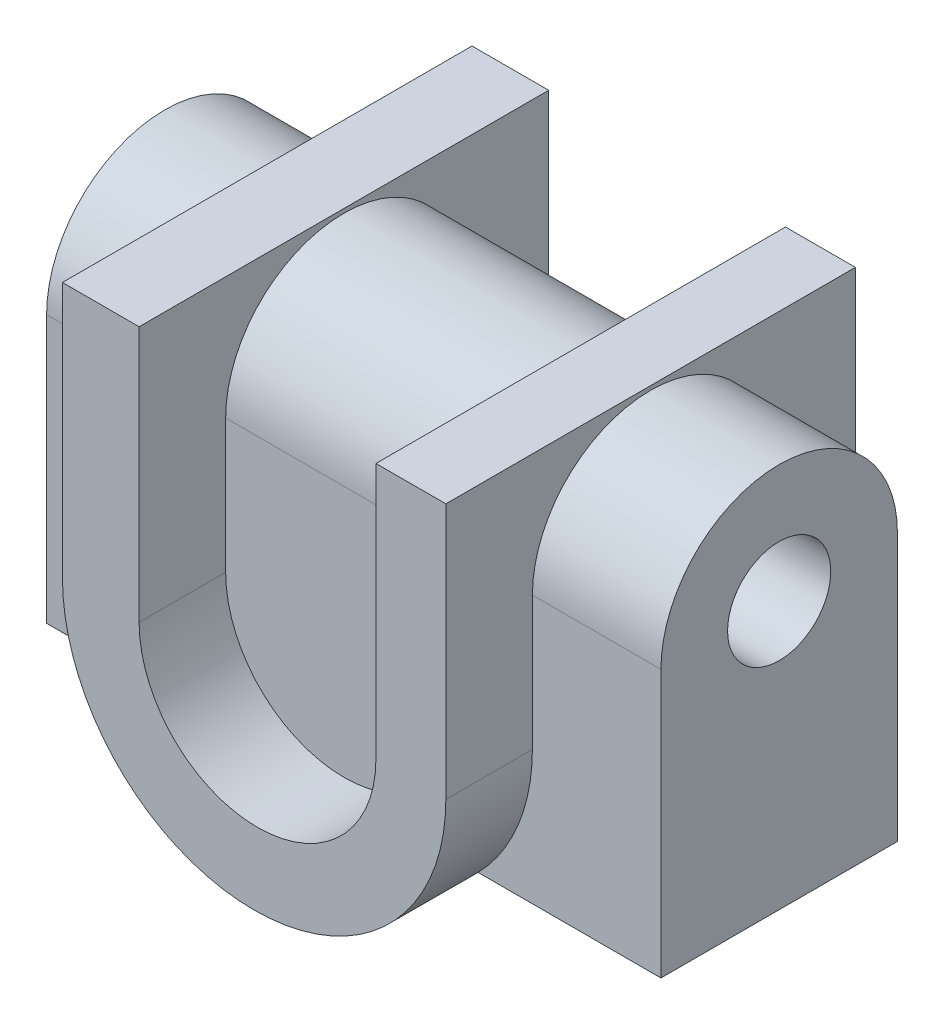
ISO-10303-21;
HEADER;
FILE_DESCRIPTION(('STEP AP214'),'2;1');
FILE_NAME('part.step','',(''),(''),'','','');
FILE_SCHEMA(('AUTOMOTIVE_DESIGN { 1 0 10303 214 1 1 1 1 }'));
ENDSEC;
DATA;
#1=APPLICATION_CONTEXT('core data for automotive mechanical design processes');
#2=APPLICATION_PROTOCOL_DEFINITION('international standard','automotive_design',2000,#1);
#3=PRODUCT_CONTEXT('',#1,'mechanical');
#4=PRODUCT('Part','Part','',(#3));
#5=PRODUCT_RELATED_PRODUCT_CATEGORY('part','',(#4));
#6=PRODUCT_DEFINITION_FORMATION('','',#4);
#7=PRODUCT_DEFINITION_CONTEXT('part definition',#1,'design');
#8=PRODUCT_DEFINITION('design','',#6,#7);
#9=PRODUCT_DEFINITION_SHAPE('','',#8);
#10=(LENGTH_UNIT() NAMED_UNIT(*) SI_UNIT(.MILLI.,.METRE.));
#11=(NAMED_UNIT(*) PLANE_ANGLE_UNIT() SI_UNIT($,.RADIAN.));
#12=(NAMED_UNIT(*) SI_UNIT($,.STERADIAN.) SOLID_ANGLE_UNIT());
#13=UNCERTAINTY_MEASURE_WITH_UNIT(LENGTH_MEASURE(1.E-05),#10,'distance_accuracy_value','');
#14=(GEOMETRIC_REPRESENTATION_CONTEXT(3) GLOBAL_UNCERTAINTY_ASSIGNED_CONTEXT((#13)) GLOBAL_UNIT_ASSIGNED_CONTEXT((#10,
#11,#12)) REPRESENTATION_CONTEXT('',''));
#15=CARTESIAN_POINT('',(0.,0.,0.));
#16=DIRECTION('',(0.,0.,1.));
#17=DIRECTION('',(1.,0.,0.));
#18=AXIS2_PLACEMENT_3D('',#15,#16,#17);
#19=CARTESIAN_POINT('',(22.4670701897335,0.,40.));
#20=DIRECTION('',(0.,0.,-1.));
#21=DIRECTION('',(-1.,0.,0.));
#22=AXIS2_PLACEMENT_3D('',#19,#20,#21);
#23=CYLINDRICAL_SURFACE('',#22,37.4451169828891);
#24=CARTESIAN_POINT('',(22.4670701897335,0.,-23.095980377482));
#25=DIRECTION('',(0.,0.,1.));
#26=DIRECTION('',(1.,0.,0.));
#27=AXIS2_PLACEMENT_3D('',#24,#25,#26);
#28=CIRCLE('',#27,37.4451169828891);
#29=CARTESIAN_POINT('',(49.3095367117541,-26.1078298002046,-23.095980377482));
#30=VERTEX_POINT('',#29);
#31=CARTESIAN_POINT('',(59.9121871726225,0.,-23.095980377482));
#32=VERTEX_POINT('',#31);
#33=EDGE_CURVE('E294',#30,#32,#28,.T.);
#34=ORIENTED_EDGE('',*,*,#33,.F.);
#35=DIRECTION('',(0.,0.,-1.));
#36=VECTOR('',#35,1.);
#37=CARTESIAN_POINT('',(49.3095367117541,-26.1078298002046,40.));
#38=LINE('',#37,#36);
#39=CARTESIAN_POINT('',(49.3095367117541,-26.1078298002046,23.095980377482));
#40=VERTEX_POINT('',#39);
#41=EDGE_CURVE('E11',#40,#30,#38,.T.);
#42=ORIENTED_EDGE('',*,*,#41,.F.);
#43=CARTESIAN_POINT('',(22.4670701897335,0.,23.095980377482));
#44=DIRECTION('',(0.,0.,-1.));
#45=DIRECTION('',(-1.,0.,0.));
#46=AXIS2_PLACEMENT_3D('',#43,#44,#45);
#47=CIRCLE('',#46,37.4451169828891);
#48=CARTESIAN_POINT('',(59.9121871726225,0.,23.095980377482));
#49=VERTEX_POINT('',#48);
#50=EDGE_CURVE('E276',#49,#40,#47,.T.);
#51=ORIENTED_EDGE('',*,*,#50,.F.);
#52=DIRECTION('',(0.,0.,-1.));
#53=VECTOR('',#52,1.);
#54=CARTESIAN_POINT('',(59.9121871726225,0.,40.));
#55=LINE('',#54,#53);
#56=CARTESIAN_POINT('',(59.9121871726225,0.,40.));
#57=VERTEX_POINT('',#56);
#58=EDGE_CURVE('E385',#57,#49,#55,.T.);
#59=ORIENTED_EDGE('',*,*,#58,.F.);
#60=CARTESIAN_POINT('',(22.4670701897335,0.,40.));
#61=DIRECTION('',(0.,0.,1.));
#62=DIRECTION('',(-1.,0.,0.));
#63=AXIS2_PLACEMENT_3D('',#60,#61,#62);
#64=CIRCLE('',#63,37.4451169828891);
#65=CARTESIAN_POINT('',(-14.9780467931556,0.,40.));
#66=VERTEX_POINT('',#65);
#67=EDGE_CURVE('E318',#66,#57,#64,.T.);
#68=ORIENTED_EDGE('',*,*,#67,.F.);
#69=DIRECTION('',(0.,0.,-1.));
#70=VECTOR('',#69,1.);
#71=CARTESIAN_POINT('',(-14.9780467931556,0.,40.));
#72=LINE('',#71,#70);
#73=CARTESIAN_POINT('',(-14.9780467931556,0.,23.095980377482));
#74=VERTEX_POINT('',#73);
#75=EDGE_CURVE('E389',#66,#74,#72,.T.);
#76=ORIENTED_EDGE('',*,*,#75,.T.);
#77=CARTESIAN_POINT('',(-4.37539633228715,-26.1078298002046,23.095980377482));
#78=VERTEX_POINT('',#77);
#79=EDGE_CURVE('E280',#78,#74,#47,.T.);
#80=ORIENTED_EDGE('',*,*,#79,.F.);
#81=DIRECTION('',(0.,0.,-1.));
#82=VECTOR('',#81,1.);
#83=CARTESIAN_POINT('',(-4.37539633228715,-26.1078298002046,40.));
#84=LINE('',#83,#82);
#85=CARTESIAN_POINT('',(-4.37539633228715,-26.1078298002046,-23.095980377482));
#86=VERTEX_POINT('',#85);
#87=EDGE_CURVE('E48',#86,#78,#84,.F.);
#88=ORIENTED_EDGE('',*,*,#87,.F.);
#89=CARTESIAN_POINT('',(-14.9780467931556,0.,-23.095980377482));
#90=VERTEX_POINT('',#89);
#91=EDGE_CURVE('E297',#90,#86,#28,.T.);
#92=ORIENTED_EDGE('',*,*,#91,.F.);
#93=CARTESIAN_POINT('',(-14.9780467931556,0.,-40.));
#94=VERTEX_POINT('',#93);
#95=EDGE_CURVE('E388',#90,#94,#72,.T.);
#96=ORIENTED_EDGE('',*,*,#95,.T.);
#97=CARTESIAN_POINT('',(22.4670701897335,0.,-40.));
#98=DIRECTION('',(0.,0.,1.));
#99=DIRECTION('',(-1.,0.,0.));
#100=AXIS2_PLACEMENT_3D('',#97,#98,#99);
#101=CIRCLE('',#100,37.4451169828891);
#102=CARTESIAN_POINT('',(59.9121871726225,0.,-40.));
#103=VERTEX_POINT('',#102);
#104=EDGE_CURVE('E344',#94,#103,#101,.T.);
#105=ORIENTED_EDGE('',*,*,#104,.T.);
#106=EDGE_CURVE('E384',#32,#103,#55,.T.);
#107=ORIENTED_EDGE('',*,*,#106,.F.);
#108=EDGE_LOOP('',(#34,#42,#51,#59,#68,#76,#80,#88,#92,#96,#105,#107));
#109=FACE_BOUND('',#108,.T.);
#110=ADVANCED_FACE('F39',(#109),#23,.T.);
#111=CARTESIAN_POINT('',(23.1278663717844,0.,40.));
#112=DIRECTION('',(0.,0.,-1.));
#113=DIRECTION('',(-1.,0.,0.));
#114=AXIS2_PLACEMENT_3D('',#111,#112,#113);
#115=CYLINDRICAL_SURFACE('',#114,23.1278663717844);
#116=CARTESIAN_POINT('',(23.1278663717844,0.,-23.095980377482));
#117=DIRECTION('',(0.,0.,1.));
#118=DIRECTION('',(1.,0.,0.));
#119=AXIS2_PLACEMENT_3D('',#116,#117,#118);
#120=CIRCLE('',#119,23.1278663717844);
#121=CARTESIAN_POINT('',(46.2557327435689,0.,-23.095980377482));
#122=VERTEX_POINT('',#121);
#123=CARTESIAN_POINT('',(0.,0.,-23.095980377482));
#124=VERTEX_POINT('',#123);
#125=EDGE_CURVE('E284',#122,#124,#120,.F.);
#126=ORIENTED_EDGE('',*,*,#125,.F.);
#127=DIRECTION('',(0.,0.,-1.));
#128=VECTOR('',#127,1.);
#129=CARTESIAN_POINT('',(46.2557327435689,0.,40.));
#130=LINE('',#129,#128);
#131=CARTESIAN_POINT('',(46.2557327435689,0.,-40.));
#132=VERTEX_POINT('',#131);
#133=EDGE_CURVE('E371',#122,#132,#130,.T.);
#134=ORIENTED_EDGE('',*,*,#133,.T.);
#135=CARTESIAN_POINT('',(23.1278663717844,0.,-40.));
#136=DIRECTION('',(0.,0.,-1.));
#137=DIRECTION('',(1.,0.,0.));
#138=AXIS2_PLACEMENT_3D('',#135,#136,#137);
#139=CIRCLE('',#138,23.1278663717844);
#140=CARTESIAN_POINT('',(0.,0.,-40.));
#141=VERTEX_POINT('',#140);
#142=EDGE_CURVE('E358',#132,#141,#139,.T.);
#143=ORIENTED_EDGE('',*,*,#142,.T.);
#144=DIRECTION('',(0.,0.,-1.));
#145=VECTOR('',#144,1.);
#146=CARTESIAN_POINT('',(0.,0.,40.));
#147=LINE('',#146,#145);
#148=EDGE_CURVE('E367',#124,#141,#147,.T.);
#149=ORIENTED_EDGE('',*,*,#148,.F.);
#150=EDGE_LOOP('',(#126,#134,#143,#149));
#151=FACE_BOUND('',#150,.T.);
#152=ADVANCED_FACE('F470',(#151),#115,.F.);
#153=CARTESIAN_POINT('',(23.1278663717844,0.,23.095980377482));
#154=DIRECTION('',(0.,0.,-1.));
#155=DIRECTION('',(-1.,0.,0.));
#156=AXIS2_PLACEMENT_3D('',#153,#154,#155);
#157=CIRCLE('',#156,23.1278663717844);
#158=CARTESIAN_POINT('',(0.,0.,23.095980377482));
#159=VERTEX_POINT('',#158);
#160=CARTESIAN_POINT('',(46.2557327435689,0.,23.095980377482));
#161=VERTEX_POINT('',#160);
#162=EDGE_CURVE('E264',#159,#161,#157,.F.);
#163=ORIENTED_EDGE('',*,*,#162,.F.);
#164=CARTESIAN_POINT('',(0.,0.,40.));
#165=VERTEX_POINT('',#164);
#166=EDGE_CURVE('E368',#165,#159,#147,.T.);
#167=ORIENTED_EDGE('',*,*,#166,.F.);
#168=CARTESIAN_POINT('',(23.1278663717844,0.,40.));
#169=DIRECTION('',(0.,0.,-1.));
#170=DIRECTION('',(1.,0.,0.));
#171=AXIS2_PLACEMENT_3D('',#168,#169,#170);
#172=CIRCLE('',#171,23.1278663717844);
#173=CARTESIAN_POINT('',(46.2557327435689,0.,40.));
#174=VERTEX_POINT('',#173);
#175=EDGE_CURVE('E330',#174,#165,#172,.T.);
#176=ORIENTED_EDGE('',*,*,#175,.F.);
#177=EDGE_CURVE('E372',#174,#161,#130,.T.);
#178=ORIENTED_EDGE('',*,*,#177,.T.);
#179=EDGE_LOOP('',(#163,#167,#176,#178));
#180=FACE_BOUND('',#179,.T.);
#181=ADVANCED_FACE('F450',(#180),#115,.F.);
#182=CARTESIAN_POINT('',(-14.9780467931556,50.0002444418578,40.));
#183=DIRECTION('',(0.,-1.,0.));
#184=DIRECTION('',(0.,0.,-1.));
#185=AXIS2_PLACEMENT_3D('',#182,#183,#184);
#186=PLANE('',#185);
#187=DIRECTION('',(-1.,0.,0.));
#188=VECTOR('',#187,1.);
#189=CARTESIAN_POINT('',(-14.9780467931556,50.0002444418578,-40.));
#190=LINE('',#189,#188);
#191=CARTESIAN_POINT('',(0.,50.0002444418578,-40.));
#192=VERTEX_POINT('',#191);
#193=CARTESIAN_POINT('',(-14.9780467931556,50.0002444418578,-40.));
#194=VERTEX_POINT('',#193);
#195=EDGE_CURVE('E309',#192,#194,#190,.T.);
#196=ORIENTED_EDGE('',*,*,#195,.T.);
#197=DIRECTION('',(0.,0.,-1.));
#198=VECTOR('',#197,1.);
#199=CARTESIAN_POINT('',(-14.9780467931556,50.0002444418578,40.));
#200=LINE('',#199,#198);
#201=CARTESIAN_POINT('',(-14.9780467931556,50.0002444418578,40.));
#202=VERTEX_POINT('',#201);
#203=EDGE_CURVE('E392',#202,#194,#200,.T.);
#204=ORIENTED_EDGE('',*,*,#203,.F.);
#205=DIRECTION('',(-1.,0.,0.));
#206=VECTOR('',#205,1.);
#207=CARTESIAN_POINT('',(-14.9780467931556,50.0002444418578,40.));
#208=LINE('',#207,#206);
#209=CARTESIAN_POINT('',(0.,50.0002444418578,40.));
#210=VERTEX_POINT('',#209);
#211=EDGE_CURVE('E310',#210,#202,#208,.T.);
#212=ORIENTED_EDGE('',*,*,#211,.F.);
#213=DIRECTION('',(0.,0.,-1.));
#214=VECTOR('',#213,1.);
#215=CARTESIAN_POINT('',(0.,50.0002444418578,40.));
#216=LINE('',#215,#214);
#217=EDGE_CURVE('E336',#210,#192,#216,.T.);
#218=ORIENTED_EDGE('',*,*,#217,.T.);
#219=EDGE_LOOP('',(#196,#204,#212,#218));
#220=FACE_BOUND('',#219,.T.);
#221=ADVANCED_FACE('F41',(#220),#186,.F.);
#222=CARTESIAN_POINT('',(-14.9780467931556,0.,40.));
#223=DIRECTION('',(1.,0.,0.));
#224=DIRECTION('',(0.,0.,-1.));
#225=AXIS2_PLACEMENT_3D('',#222,#223,#224);
#226=PLANE('',#225);
#227=DIRECTION('',(0.,-1.,0.));
#228=VECTOR('',#227,1.);
#229=CARTESIAN_POINT('',(-14.9780467931556,0.,-23.095980377482));
#230=LINE('',#229,#228);
#231=CARTESIAN_POINT('',(-14.9780467931556,26.1078298002046,-23.095980377482));
#232=VERTEX_POINT('',#231);
#233=EDGE_CURVE('E55',#232,#90,#230,.T.);
#234=ORIENTED_EDGE('',*,*,#233,.F.);
#235=CARTESIAN_POINT('',(-14.9780467931556,26.1078298002046,0.));
#236=DIRECTION('',(1.,0.,0.));
#237=DIRECTION('',(0.,0.,-1.));
#238=AXIS2_PLACEMENT_3D('',#235,#236,#237);
#239=CIRCLE('',#238,23.095980377482);
#240=CARTESIAN_POINT('',(-14.9780467931556,26.1078298002046,23.095980377482));
#241=VERTEX_POINT('',#240);
#242=EDGE_CURVE('E59',#241,#232,#239,.F.);
#243=ORIENTED_EDGE('',*,*,#242,.F.);
#244=DIRECTION('',(0.,1.,0.));
#245=VECTOR('',#244,1.);
#246=CARTESIAN_POINT('',(-14.9780467931556,0.,23.095980377482));
#247=LINE('',#246,#245);
#248=EDGE_CURVE('E281',#74,#241,#247,.T.);
#249=ORIENTED_EDGE('',*,*,#248,.F.);
#250=ORIENTED_EDGE('',*,*,#75,.F.);
#251=DIRECTION('',(0.,-1.,0.));
#252=VECTOR('',#251,1.);
#253=CARTESIAN_POINT('',(-14.9780467931556,0.,40.));
#254=LINE('',#253,#252);
#255=EDGE_CURVE('E314',#202,#66,#254,.T.);
#256=ORIENTED_EDGE('',*,*,#255,.F.);
#257=ORIENTED_EDGE('',*,*,#203,.T.);
#258=DIRECTION('',(0.,-1.,0.));
#259=VECTOR('',#258,1.);
#260=CARTESIAN_POINT('',(-14.9780467931556,0.,-40.));
#261=LINE('',#260,#259);
#262=EDGE_CURVE('E340',#194,#94,#261,.T.);
#263=ORIENTED_EDGE('',*,*,#262,.T.);
#264=ORIENTED_EDGE('',*,*,#95,.F.);
#265=EDGE_LOOP('',(#234,#243,#249,#250,#256,#257,#263,#264));
#266=FACE_BOUND('',#265,.T.);
#267=ADVANCED_FACE('F500',(#266),#226,.F.);
#268=CARTESIAN_POINT('',(59.9121871726225,50.0002444418578,40.));
#269=DIRECTION('',(-1.,0.,0.));
#270=DIRECTION('',(0.,0.,1.));
#271=AXIS2_PLACEMENT_3D('',#268,#269,#270);
#272=PLANE('',#271);
#273=DIRECTION('',(0.,1.,0.));
#274=VECTOR('',#273,1.);
#275=CARTESIAN_POINT('',(59.9121871726225,50.0002444418578,-23.095980377482));
#276=LINE('',#275,#274);
#277=CARTESIAN_POINT('',(59.9121871726225,26.1078298002046,-23.095980377482));
#278=VERTEX_POINT('',#277);
#279=EDGE_CURVE('E196',#32,#278,#276,.T.);
#280=ORIENTED_EDGE('',*,*,#279,.F.);
#281=ORIENTED_EDGE('',*,*,#106,.T.);
#282=DIRECTION('',(0.,1.,0.));
#283=VECTOR('',#282,1.);
#284=CARTESIAN_POINT('',(59.9121871726225,50.0002444418578,-40.));
#285=LINE('',#284,#283);
#286=CARTESIAN_POINT('',(59.9121871726225,50.0002444418578,-40.));
#287=VERTEX_POINT('',#286);
#288=EDGE_CURVE('E348',#103,#287,#285,.T.);
#289=ORIENTED_EDGE('',*,*,#288,.T.);
#290=DIRECTION('',(0.,0.,-1.));
#291=VECTOR('',#290,1.);
#292=CARTESIAN_POINT('',(59.9121871726225,50.0002444418578,40.));
#293=LINE('',#292,#291);
#294=CARTESIAN_POINT('',(59.9121871726225,50.0002444418578,40.));
#295=VERTEX_POINT('',#294);
#296=EDGE_CURVE('E380',#295,#287,#293,.T.);
#297=ORIENTED_EDGE('',*,*,#296,.F.);
#298=DIRECTION('',(0.,1.,0.));
#299=VECTOR('',#298,1.);
#300=CARTESIAN_POINT('',(59.9121871726225,50.0002444418578,40.));
#301=LINE('',#300,#299);
#302=EDGE_CURVE('E321',#57,#295,#301,.T.);
#303=ORIENTED_EDGE('',*,*,#302,.F.);
#304=ORIENTED_EDGE('',*,*,#58,.T.);
#305=DIRECTION('',(0.,-1.,0.));
#306=VECTOR('',#305,1.);
#307=CARTESIAN_POINT('',(59.9121871726225,50.0002444418578,23.095980377482));
#308=LINE('',#307,#306);
#309=CARTESIAN_POINT('',(59.9121871726225,26.1078298002046,23.095980377482));
#310=VERTEX_POINT('',#309);
#311=EDGE_CURVE('E272',#310,#49,#308,.T.);
#312=ORIENTED_EDGE('',*,*,#311,.F.);
#313=CARTESIAN_POINT('',(59.9121871726225,26.1078298002046,0.));
#314=DIRECTION('',(-1.,0.,0.));
#315=DIRECTION('',(0.,0.,1.));
#316=AXIS2_PLACEMENT_3D('',#313,#314,#315);
#317=CIRCLE('',#316,23.095980377482);
#318=EDGE_CURVE('E304',#278,#310,#317,.F.);
#319=ORIENTED_EDGE('',*,*,#318,.F.);
#320=EDGE_LOOP('',(#280,#281,#289,#297,#303,#304,#312,#319));
#321=FACE_BOUND('',#320,.T.);
#322=ADVANCED_FACE('F498',(#321),#272,.F.);
#323=CARTESIAN_POINT('',(46.2557327435689,50.0002444418578,40.));
#324=DIRECTION('',(0.,-1.,0.));
#325=DIRECTION('',(0.,0.,-1.));
#326=AXIS2_PLACEMENT_3D('',#323,#324,#325);
#327=PLANE('',#326);
#328=DIRECTION('',(-1.,0.,0.));
#329=VECTOR('',#328,1.);
#330=CARTESIAN_POINT('',(46.2557327435689,50.0002444418578,-40.));
#331=LINE('',#330,#329);
#332=CARTESIAN_POINT('',(46.2557327435689,50.0002444418578,-40.));
#333=VERTEX_POINT('',#332);
#334=EDGE_CURVE('E351',#287,#333,#331,.T.);
#335=ORIENTED_EDGE('',*,*,#334,.T.);
#336=DIRECTION('',(0.,0.,-1.));
#337=VECTOR('',#336,1.);
#338=CARTESIAN_POINT('',(46.2557327435689,50.0002444418578,40.));
#339=LINE('',#338,#337);
#340=CARTESIAN_POINT('',(46.2557327435689,50.0002444418578,40.));
#341=VERTEX_POINT('',#340);
#342=EDGE_CURVE('E376',#341,#333,#339,.T.);
#343=ORIENTED_EDGE('',*,*,#342,.F.);
#344=DIRECTION('',(-1.,0.,0.));
#345=VECTOR('',#344,1.);
#346=CARTESIAN_POINT('',(46.2557327435689,50.0002444418578,40.));
#347=LINE('',#346,#345);
#348=EDGE_CURVE('E324',#295,#341,#347,.T.);
#349=ORIENTED_EDGE('',*,*,#348,.F.);
#350=ORIENTED_EDGE('',*,*,#296,.T.);
#351=EDGE_LOOP('',(#335,#343,#349,#350));
#352=FACE_BOUND('',#351,.T.);
#353=ADVANCED_FACE('F506',(#352),#327,.F.);
#354=CARTESIAN_POINT('',(46.2557327435689,0.,40.));
#355=DIRECTION('',(1.,0.,0.));
#356=DIRECTION('',(0.,0.,-1.));
#357=AXIS2_PLACEMENT_3D('',#354,#355,#356);
#358=PLANE('',#357);
#359=DIRECTION('',(0.,-1.,0.));
#360=VECTOR('',#359,1.);
#361=CARTESIAN_POINT('',(46.2557327435689,0.,-23.095980377482));
#362=LINE('',#361,#360);
#363=CARTESIAN_POINT('',(46.2557327435689,26.1078298002046,-23.095980377482));
#364=VERTEX_POINT('',#363);
#365=EDGE_CURVE('E288',#364,#122,#362,.T.);
#366=ORIENTED_EDGE('',*,*,#365,.F.);
#367=CARTESIAN_POINT('',(46.2557327435689,26.1078298002046,0.));
#368=DIRECTION('',(1.,0.,0.));
#369=DIRECTION('',(0.,0.,-1.));
#370=AXIS2_PLACEMENT_3D('',#367,#368,#369);
#371=CIRCLE('',#370,23.095980377482);
#372=CARTESIAN_POINT('',(46.2557327435689,26.1078298002046,23.095980377482));
#373=VERTEX_POINT('',#372);
#374=EDGE_CURVE('E300',#373,#364,#371,.F.);
#375=ORIENTED_EDGE('',*,*,#374,.F.);
#376=DIRECTION('',(0.,1.,0.));
#377=VECTOR('',#376,1.);
#378=CARTESIAN_POINT('',(46.2557327435689,0.,23.095980377482));
#379=LINE('',#378,#377);
#380=EDGE_CURVE('E268',#161,#373,#379,.T.);
#381=ORIENTED_EDGE('',*,*,#380,.F.);
#382=ORIENTED_EDGE('',*,*,#177,.F.);
#383=DIRECTION('',(0.,-1.,0.));
#384=VECTOR('',#383,1.);
#385=CARTESIAN_POINT('',(46.2557327435689,0.,40.));
#386=LINE('',#385,#384);
#387=EDGE_CURVE('E327',#341,#174,#386,.T.);
#388=ORIENTED_EDGE('',*,*,#387,.F.);
#389=ORIENTED_EDGE('',*,*,#342,.T.);
#390=DIRECTION('',(0.,-1.,0.));
#391=VECTOR('',#390,1.);
#392=CARTESIAN_POINT('',(46.2557327435689,0.,-40.));
#393=LINE('',#392,#391);
#394=EDGE_CURVE('E354',#333,#132,#393,.T.);
#395=ORIENTED_EDGE('',*,*,#394,.T.);
#396=ORIENTED_EDGE('',*,*,#133,.F.);
#397=EDGE_LOOP('',(#366,#375,#381,#382,#388,#389,#395,#396));
#398=FACE_BOUND('',#397,.T.);
#399=ADVANCED_FACE('F446',(#398),#358,.F.);
#400=CARTESIAN_POINT('',(0.,50.0002444418578,40.));
#401=DIRECTION('',(-1.,0.,0.));
#402=DIRECTION('',(0.,0.,1.));
#403=AXIS2_PLACEMENT_3D('',#400,#401,#402);
#404=PLANE('',#403);
#405=DIRECTION('',(0.,1.,0.));
#406=VECTOR('',#405,1.);
#407=CARTESIAN_POINT('',(0.,50.0002444418578,-23.095980377482));
#408=LINE('',#407,#406);
#409=CARTESIAN_POINT('',(0.,26.1078298002046,-23.095980377482));
#410=VERTEX_POINT('',#409);
#411=EDGE_CURVE('E404',#124,#410,#408,.T.);
#412=ORIENTED_EDGE('',*,*,#411,.F.);
#413=ORIENTED_EDGE('',*,*,#148,.T.);
#414=DIRECTION('',(0.,1.,0.));
#415=VECTOR('',#414,1.);
#416=CARTESIAN_POINT('',(0.,50.0002444418578,-40.));
#417=LINE('',#416,#415);
#418=EDGE_CURVE('E315',#141,#192,#417,.T.);
#419=ORIENTED_EDGE('',*,*,#418,.T.);
#420=ORIENTED_EDGE('',*,*,#217,.F.);
#421=DIRECTION('',(0.,1.,0.));
#422=VECTOR('',#421,1.);
#423=CARTESIAN_POINT('',(0.,50.0002444418578,40.));
#424=LINE('',#423,#422);
#425=EDGE_CURVE('E333',#165,#210,#424,.T.);
#426=ORIENTED_EDGE('',*,*,#425,.F.);
#427=ORIENTED_EDGE('',*,*,#166,.T.);
#428=DIRECTION('',(0.,-1.,0.));
#429=VECTOR('',#428,1.);
#430=CARTESIAN_POINT('',(0.,50.0002444418578,23.095980377482));
#431=LINE('',#430,#429);
#432=CARTESIAN_POINT('',(0.,26.1078298002046,23.095980377482));
#433=VERTEX_POINT('',#432);
#434=EDGE_CURVE('E396',#433,#159,#431,.T.);
#435=ORIENTED_EDGE('',*,*,#434,.F.);
#436=CARTESIAN_POINT('',(0.,26.1078298002046,0.));
#437=DIRECTION('',(-1.,0.,0.));
#438=DIRECTION('',(0.,0.,1.));
#439=AXIS2_PLACEMENT_3D('',#436,#437,#438);
#440=CIRCLE('',#439,23.095980377482);
#441=EDGE_CURVE('E400',#410,#433,#440,.F.);
#442=ORIENTED_EDGE('',*,*,#441,.F.);
#443=EDGE_LOOP('',(#412,#413,#419,#420,#426,#427,#435,#442));
#444=FACE_BOUND('',#443,.T.);
#445=ADVANCED_FACE('F474',(#444),#404,.F.);
#446=CARTESIAN_POINT('',(23.1278663717844,0.,40.));
#447=DIRECTION('',(0.,0.,1.));
#448=DIRECTION('',(1.,0.,0.));
#449=AXIS2_PLACEMENT_3D('',#446,#447,#448);
#450=PLANE('',#449);
#451=ORIENTED_EDGE('',*,*,#211,.T.);
#452=ORIENTED_EDGE('',*,*,#255,.T.);
#453=ORIENTED_EDGE('',*,*,#67,.T.);
#454=ORIENTED_EDGE('',*,*,#302,.T.);
#455=ORIENTED_EDGE('',*,*,#348,.T.);
#456=ORIENTED_EDGE('',*,*,#387,.T.);
#457=ORIENTED_EDGE('',*,*,#175,.T.);
#458=ORIENTED_EDGE('',*,*,#425,.T.);
#459=EDGE_LOOP('',(#451,#452,#453,#454,#455,#456,#457,#458));
#460=FACE_BOUND('',#459,.T.);
#461=ADVANCED_FACE('F454',(#460),#450,.T.);
#462=CARTESIAN_POINT('',(23.1278663717844,0.,-40.));
#463=DIRECTION('',(0.,0.,1.));
#464=DIRECTION('',(1.,0.,0.));
#465=AXIS2_PLACEMENT_3D('',#462,#463,#464);
#466=PLANE('',#465);
#467=ORIENTED_EDGE('',*,*,#195,.F.);
#468=ORIENTED_EDGE('',*,*,#418,.F.);
#469=ORIENTED_EDGE('',*,*,#142,.F.);
#470=ORIENTED_EDGE('',*,*,#394,.F.);
#471=ORIENTED_EDGE('',*,*,#334,.F.);
#472=ORIENTED_EDGE('',*,*,#288,.F.);
#473=ORIENTED_EDGE('',*,*,#104,.F.);
#474=ORIENTED_EDGE('',*,*,#262,.F.);
#475=EDGE_LOOP('',(#467,#468,#469,#470,#471,#472,#473,#474));
#476=FACE_BOUND('',#475,.T.);
#477=ADVANCED_FACE('F465',(#476),#466,.F.);
#478=CARTESIAN_POINT('',(-34.9780467931556,-26.1078298002046,-23.095980377482));
#479=DIRECTION('',(0.,0.,1.));
#480=DIRECTION('',(1.,0.,0.));
#481=AXIS2_PLACEMENT_3D('',#478,#479,#480);
#482=PLANE('',#481);
#483=DIRECTION('',(1.,0.,0.));
#484=VECTOR('',#483,1.);
#485=CARTESIAN_POINT('',(-34.9780467931556,26.1078298002046,-23.095980377482));
#486=LINE('',#485,#484);
#487=EDGE_CURVE('E201',#410,#364,#486,.T.);
#488=ORIENTED_EDGE('',*,*,#487,.T.);
#489=ORIENTED_EDGE('',*,*,#365,.T.);
#490=ORIENTED_EDGE('',*,*,#125,.T.);
#491=ORIENTED_EDGE('',*,*,#411,.T.);
#492=EDGE_LOOP('',(#488,#489,#490,#491));
#493=FACE_BOUND('',#492,.T.);
#494=ADVANCED_FACE('F476',(#493),#482,.F.);
#495=CARTESIAN_POINT('',(-34.9780467931556,-26.1078298002046,23.095980377482));
#496=DIRECTION('',(0.,0.,-1.));
#497=DIRECTION('',(-1.,0.,0.));
#498=AXIS2_PLACEMENT_3D('',#495,#496,#497);
#499=PLANE('',#498);
#500=ORIENTED_EDGE('',*,*,#162,.T.);
#501=ORIENTED_EDGE('',*,*,#380,.T.);
#502=DIRECTION('',(1.,0.,0.));
#503=VECTOR('',#502,1.);
#504=CARTESIAN_POINT('',(-34.9780467931556,26.1078298002046,23.095980377482));
#505=LINE('',#504,#503);
#506=EDGE_CURVE('E253',#433,#373,#505,.T.);
#507=ORIENTED_EDGE('',*,*,#506,.F.);
#508=ORIENTED_EDGE('',*,*,#434,.T.);
#509=EDGE_LOOP('',(#500,#501,#507,#508));
#510=FACE_BOUND('',#509,.T.);
#511=ADVANCED_FACE('F442',(#510),#499,.F.);
#512=CARTESIAN_POINT('',(-34.9780467931556,26.1078298002046,0.));
#513=DIRECTION('',(1.,0.,0.));
#514=DIRECTION('',(0.,0.,-1.));
#515=AXIS2_PLACEMENT_3D('',#512,#513,#514);
#516=CYLINDRICAL_SURFACE('',#515,23.095980377482);
#517=ORIENTED_EDGE('',*,*,#506,.T.);
#518=ORIENTED_EDGE('',*,*,#374,.T.);
#519=ORIENTED_EDGE('',*,*,#487,.F.);
#520=ORIENTED_EDGE('',*,*,#441,.T.);
#521=EDGE_LOOP('',(#517,#518,#519,#520));
#522=FACE_BOUND('',#521,.T.);
#523=ADVANCED_FACE('F439',(#522),#516,.T.);
#524=ORIENTED_EDGE('',*,*,#311,.T.);
#525=ORIENTED_EDGE('',*,*,#50,.T.);
#526=DIRECTION('',(1.,0.,0.));
#527=VECTOR('',#526,1.);
#528=CARTESIAN_POINT('',(-34.9780467931556,-26.1078298002046,23.095980377482));
#529=LINE('',#528,#527);
#530=CARTESIAN_POINT('',(85.0219532068444,-26.1078298002046,23.095980377482));
#531=VERTEX_POINT('',#530);
#532=EDGE_CURVE('E252',#40,#531,#529,.T.);
#533=ORIENTED_EDGE('',*,*,#532,.T.);
#534=DIRECTION('',(0.,1.,0.));
#535=VECTOR('',#534,1.);
#536=CARTESIAN_POINT('',(85.0219532068444,-26.1078298002046,23.095980377482));
#537=LINE('',#536,#535);
#538=CARTESIAN_POINT('',(85.0219532068444,26.1078298002046,23.095980377482));
#539=VERTEX_POINT('',#538);
#540=EDGE_CURVE('E228',#531,#539,#537,.T.);
#541=ORIENTED_EDGE('',*,*,#540,.T.);
#542=EDGE_CURVE('E218',#310,#539,#505,.T.);
#543=ORIENTED_EDGE('',*,*,#542,.F.);
#544=EDGE_LOOP('',(#524,#525,#533,#541,#543));
#545=FACE_BOUND('',#544,.T.);
#546=ADVANCED_FACE('F484',(#545),#499,.F.);
#547=DIRECTION('',(1.,0.,0.));
#548=VECTOR('',#547,1.);
#549=CARTESIAN_POINT('',(-34.9780467931556,-26.1078298002046,-23.095980377482));
#550=LINE('',#549,#548);
#551=CARTESIAN_POINT('',(85.0219532068444,-26.1078298002046,-23.095980377482));
#552=VERTEX_POINT('',#551);
#553=EDGE_CURVE('E258',#30,#552,#550,.T.);
#554=ORIENTED_EDGE('',*,*,#553,.F.);
#555=ORIENTED_EDGE('',*,*,#33,.T.);
#556=ORIENTED_EDGE('',*,*,#279,.T.);
#557=CARTESIAN_POINT('',(85.0219532068444,26.1078298002046,-23.095980377482));
#558=VERTEX_POINT('',#557);
#559=EDGE_CURVE('E190',#278,#558,#486,.T.);
#560=ORIENTED_EDGE('',*,*,#559,.T.);
#561=DIRECTION('',(0.,-1.,0.));
#562=VECTOR('',#561,1.);
#563=CARTESIAN_POINT('',(85.0219532068444,-26.1078298002046,-23.095980377482));
#564=LINE('',#563,#562);
#565=EDGE_CURVE('E194',#558,#552,#564,.T.);
#566=ORIENTED_EDGE('',*,*,#565,.T.);
#567=EDGE_LOOP('',(#554,#555,#556,#560,#566));
#568=FACE_BOUND('',#567,.T.);
#569=ADVANCED_FACE('F193',(#568),#482,.F.);
#570=ORIENTED_EDGE('',*,*,#559,.F.);
#571=ORIENTED_EDGE('',*,*,#318,.T.);
#572=ORIENTED_EDGE('',*,*,#542,.T.);
#573=CARTESIAN_POINT('',(85.0219532068444,26.1078298002046,0.));
#574=DIRECTION('',(-1.,0.,0.));
#575=DIRECTION('',(0.,0.,1.));
#576=AXIS2_PLACEMENT_3D('',#573,#574,#575);
#577=CIRCLE('',#576,23.095980377482);
#578=EDGE_CURVE('E210',#539,#558,#577,.T.);
#579=ORIENTED_EDGE('',*,*,#578,.T.);
#580=EDGE_LOOP('',(#570,#571,#572,#579));
#581=FACE_BOUND('',#580,.T.);
#582=ADVANCED_FACE('F216',(#581),#516,.T.);
#583=CARTESIAN_POINT('',(-34.9780467931556,-26.1078298002046,-23.095980377482));
#584=DIRECTION('',(0.,1.,0.));
#585=DIRECTION('',(0.,0.,1.));
#586=AXIS2_PLACEMENT_3D('',#583,#584,#585);
#587=PLANE('',#586);
#588=ORIENTED_EDGE('',*,*,#532,.F.);
#589=ORIENTED_EDGE('',*,*,#41,.T.);
#590=ORIENTED_EDGE('',*,*,#553,.T.);
#591=DIRECTION('',(0.,0.,1.));
#592=VECTOR('',#591,1.);
#593=CARTESIAN_POINT('',(85.0219532068444,-26.1078298002046,-23.095980377482));
#594=LINE('',#593,#592);
#595=EDGE_CURVE('E213',#552,#531,#594,.T.);
#596=ORIENTED_EDGE('',*,*,#595,.T.);
#597=EDGE_LOOP('',(#588,#589,#590,#596));
#598=FACE_BOUND('',#597,.T.);
#599=ADVANCED_FACE('F535',(#598),#587,.F.);
#600=CARTESIAN_POINT('',(85.0219532068444,26.1078298002046,0.));
#601=DIRECTION('',(-1.,0.,0.));
#602=DIRECTION('',(0.,0.,1.));
#603=AXIS2_PLACEMENT_3D('',#600,#601,#602);
#604=PLANE('',#603);
#605=CARTESIAN_POINT('',(85.0219532068444,26.1078298002046,0.));
#606=DIRECTION('',(-1.,0.,0.));
#607=DIRECTION('',(0.,0.,1.));
#608=AXIS2_PLACEMENT_3D('',#605,#606,#607);
#609=CIRCLE('',#608,10.0768910081598);
#610=CARTESIAN_POINT('',(85.0219532068444,26.1078298002046,10.0768910081598));
#611=VERTEX_POINT('',#610);
#612=EDGE_CURVE('E220',#611,#611,#609,.T.);
#613=ORIENTED_EDGE('',*,*,#612,.T.);
#614=EDGE_LOOP('',(#613));
#615=FACE_BOUND('',#614,.T.);
#616=ORIENTED_EDGE('',*,*,#578,.F.);
#617=ORIENTED_EDGE('',*,*,#540,.F.);
#618=ORIENTED_EDGE('',*,*,#595,.F.);
#619=ORIENTED_EDGE('',*,*,#565,.F.);
#620=EDGE_LOOP('',(#616,#617,#618,#619));
#621=FACE_BOUND('',#620,.T.);
#622=ADVANCED_FACE('F208',(#615,#621),#604,.F.);
#623=CARTESIAN_POINT('',(-34.9780467931556,-26.1078298002046,-23.095980377482));
#624=VERTEX_POINT('',#623);
#625=EDGE_CURVE('E202',#624,#86,#550,.T.);
#626=ORIENTED_EDGE('',*,*,#625,.T.);
#627=ORIENTED_EDGE('',*,*,#87,.T.);
#628=CARTESIAN_POINT('',(-34.9780467931556,-26.1078298002046,23.095980377482));
#629=VERTEX_POINT('',#628);
#630=EDGE_CURVE('E254',#629,#78,#529,.T.);
#631=ORIENTED_EDGE('',*,*,#630,.F.);
#632=DIRECTION('',(0.,0.,1.));
#633=VECTOR('',#632,1.);
#634=CARTESIAN_POINT('',(-34.9780467931556,-26.1078298002046,-23.095980377482));
#635=LINE('',#634,#633);
#636=EDGE_CURVE('E242',#624,#629,#635,.T.);
#637=ORIENTED_EDGE('',*,*,#636,.F.);
#638=EDGE_LOOP('',(#626,#627,#631,#637));
#639=FACE_BOUND('',#638,.T.);
#640=ADVANCED_FACE('F411',(#639),#587,.F.);
#641=CARTESIAN_POINT('',(-34.9780467931556,26.1078298002046,23.095980377482));
#642=VERTEX_POINT('',#641);
#643=EDGE_CURVE('E248',#642,#241,#505,.T.);
#644=ORIENTED_EDGE('',*,*,#643,.T.);
#645=ORIENTED_EDGE('',*,*,#242,.T.);
#646=CARTESIAN_POINT('',(-34.9780467931556,26.1078298002046,-23.095980377482));
#647=VERTEX_POINT('',#646);
#648=EDGE_CURVE('E204',#647,#232,#486,.T.);
#649=ORIENTED_EDGE('',*,*,#648,.F.);
#650=CARTESIAN_POINT('',(-34.9780467931556,26.1078298002046,0.));
#651=DIRECTION('',(-1.,0.,0.));
#652=DIRECTION('',(0.,0.,1.));
#653=AXIS2_PLACEMENT_3D('',#650,#651,#652);
#654=CIRCLE('',#653,23.095980377482);
#655=EDGE_CURVE('E235',#642,#647,#654,.T.);
#656=ORIENTED_EDGE('',*,*,#655,.F.);
#657=EDGE_LOOP('',(#644,#645,#649,#656));
#658=FACE_BOUND('',#657,.T.);
#659=ADVANCED_FACE('F489',(#658),#516,.T.);
#660=ORIENTED_EDGE('',*,*,#648,.T.);
#661=ORIENTED_EDGE('',*,*,#233,.T.);
#662=ORIENTED_EDGE('',*,*,#91,.T.);
#663=ORIENTED_EDGE('',*,*,#625,.F.);
#664=DIRECTION('',(0.,-1.,0.));
#665=VECTOR('',#664,1.);
#666=CARTESIAN_POINT('',(-34.9780467931556,-26.1078298002046,-23.095980377482));
#667=LINE('',#666,#665);
#668=EDGE_CURVE('E239',#647,#624,#667,.T.);
#669=ORIENTED_EDGE('',*,*,#668,.F.);
#670=EDGE_LOOP('',(#660,#661,#662,#663,#669));
#671=FACE_BOUND('',#670,.T.);
#672=ADVANCED_FACE('F427',(#671),#482,.F.);
#673=ORIENTED_EDGE('',*,*,#79,.T.);
#674=ORIENTED_EDGE('',*,*,#248,.T.);
#675=ORIENTED_EDGE('',*,*,#643,.F.);
#676=DIRECTION('',(0.,1.,0.));
#677=VECTOR('',#676,1.);
#678=CARTESIAN_POINT('',(-34.9780467931556,-26.1078298002046,23.095980377482));
#679=LINE('',#678,#677);
#680=EDGE_CURVE('E245',#629,#642,#679,.T.);
#681=ORIENTED_EDGE('',*,*,#680,.F.);
#682=ORIENTED_EDGE('',*,*,#630,.T.);
#683=EDGE_LOOP('',(#673,#674,#675,#681,#682));
#684=FACE_BOUND('',#683,.T.);
#685=ADVANCED_FACE('F419',(#684),#499,.F.);
#686=CARTESIAN_POINT('',(-34.9780467931556,26.1078298002046,0.));
#687=DIRECTION('',(1.,0.,0.));
#688=DIRECTION('',(0.,0.,-1.));
#689=AXIS2_PLACEMENT_3D('',#686,#687,#688);
#690=CYLINDRICAL_SURFACE('',#689,10.0768910081598);
#691=CARTESIAN_POINT('',(-34.9780467931556,26.1078298002046,0.));
#692=DIRECTION('',(-1.,0.,0.));
#693=DIRECTION('',(0.,0.,1.));
#694=AXIS2_PLACEMENT_3D('',#691,#692,#693);
#695=CIRCLE('',#694,10.0768910081598);
#696=CARTESIAN_POINT('',(-34.9780467931556,26.1078298002046,10.0768910081598));
#697=VERTEX_POINT('',#696);
#698=EDGE_CURVE('E231',#697,#697,#695,.T.);
#699=ORIENTED_EDGE('',*,*,#698,.T.);
#700=EDGE_LOOP('',(#699));
#701=FACE_BOUND('',#700,.T.);
#702=ORIENTED_EDGE('',*,*,#612,.F.);
#703=EDGE_LOOP('',(#702));
#704=FACE_BOUND('',#703,.T.);
#705=ADVANCED_FACE('F546',(#701,#704),#690,.F.);
#706=CARTESIAN_POINT('',(-34.9780467931556,26.1078298002046,0.));
#707=DIRECTION('',(-1.,0.,0.));
#708=DIRECTION('',(0.,0.,1.));
#709=AXIS2_PLACEMENT_3D('',#706,#707,#708);
#710=PLANE('',#709);
#711=ORIENTED_EDGE('',*,*,#655,.T.);
#712=ORIENTED_EDGE('',*,*,#668,.T.);
#713=ORIENTED_EDGE('',*,*,#636,.T.);
#714=ORIENTED_EDGE('',*,*,#680,.T.);
#715=EDGE_LOOP('',(#711,#712,#713,#714));
#716=FACE_BOUND('',#715,.T.);
#717=ORIENTED_EDGE('',*,*,#698,.F.);
#718=EDGE_LOOP('',(#717));
#719=FACE_BOUND('',#718,.T.);
#720=ADVANCED_FACE('F423',(#716,#719),#710,.T.);
#721=CLOSED_SHELL('',(#110,#152,#181,#221,#267,#322,#353,#399,#445,#461,#477,#494,#511,#523,
#546,#569,#582,#599,#622,#640,#659,#672,#685,#705,#720));
#722=MANIFOLD_SOLID_BREP('B2',#721);
#723=ADVANCED_BREP_SHAPE_REPRESENTATION('',(#18,#722),#14);
#724=SHAPE_DEFINITION_REPRESENTATION(#9,#723);
ENDSEC;
END-ISO-10303-21;
